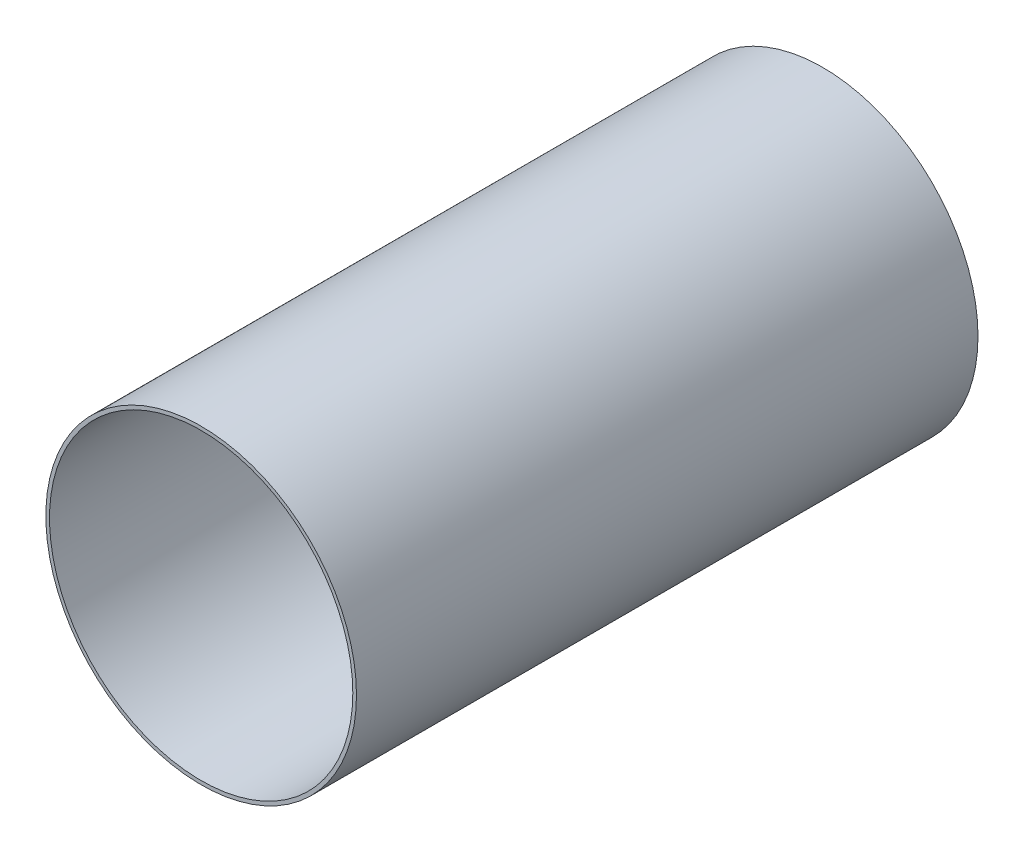
ISO-10303-21;
HEADER;
FILE_DESCRIPTION(('STEP AP214'),'2;1');
FILE_NAME('part.step','',(''),(''),'','','');
FILE_SCHEMA(('AUTOMOTIVE_DESIGN { 1 0 10303 214 1 1 1 1 }'));
ENDSEC;
DATA;
#1=APPLICATION_CONTEXT('core data for automotive mechanical design processes');
#2=APPLICATION_PROTOCOL_DEFINITION('international standard','automotive_design',2000,#1);
#3=PRODUCT_CONTEXT('',#1,'mechanical');
#4=PRODUCT('Part','Part','',(#3));
#5=PRODUCT_RELATED_PRODUCT_CATEGORY('part','',(#4));
#6=PRODUCT_DEFINITION_FORMATION('','',#4);
#7=PRODUCT_DEFINITION_CONTEXT('part definition',#1,'design');
#8=PRODUCT_DEFINITION('design','',#6,#7);
#9=PRODUCT_DEFINITION_SHAPE('','',#8);
#10=(LENGTH_UNIT() NAMED_UNIT(*) SI_UNIT(.MILLI.,.METRE.));
#11=(NAMED_UNIT(*) PLANE_ANGLE_UNIT() SI_UNIT($,.RADIAN.));
#12=(NAMED_UNIT(*) SI_UNIT($,.STERADIAN.) SOLID_ANGLE_UNIT());
#13=UNCERTAINTY_MEASURE_WITH_UNIT(LENGTH_MEASURE(1.E-05),#10,'distance_accuracy_value','');
#14=(GEOMETRIC_REPRESENTATION_CONTEXT(3) GLOBAL_UNCERTAINTY_ASSIGNED_CONTEXT((#13)) GLOBAL_UNIT_ASSIGNED_CONTEXT((#10,
#11,#12)) REPRESENTATION_CONTEXT('',''));
#15=CARTESIAN_POINT('',(0.,0.,0.));
#16=DIRECTION('',(0.,0.,1.));
#17=DIRECTION('',(1.,0.,0.));
#18=AXIS2_PLACEMENT_3D('',#15,#16,#17);
#19=CARTESIAN_POINT('',(0.,0.,127.));
#20=DIRECTION('',(0.,0.,1.));
#21=DIRECTION('',(1.,0.,0.));
#22=AXIS2_PLACEMENT_3D('',#19,#20,#21);
#23=PLANE('',#22);
#24=CARTESIAN_POINT('',(0.,0.,127.));
#25=DIRECTION('',(0.,0.,1.));
#26=DIRECTION('',(1.,0.,0.));
#27=AXIS2_PLACEMENT_3D('',#24,#25,#26);
#28=CIRCLE('',#27,63.4746);
#29=CARTESIAN_POINT('',(63.4746,0.,127.));
#30=VERTEX_POINT('',#29);
#31=EDGE_CURVE('E10',#30,#30,#28,.T.);
#32=ORIENTED_EDGE('',*,*,#31,.T.);
#33=EDGE_LOOP('',(#32));
#34=FACE_BOUND('',#33,.T.);
#35=CARTESIAN_POINT('',(0.,0.,127.));
#36=DIRECTION('',(0.,0.,1.));
#37=DIRECTION('',(1.,0.,0.));
#38=AXIS2_PLACEMENT_3D('',#35,#36,#37);
#39=CIRCLE('',#38,61.976);
#40=CARTESIAN_POINT('',(61.976,0.,127.));
#41=VERTEX_POINT('',#40);
#42=EDGE_CURVE('E54',#41,#41,#39,.T.);
#43=ORIENTED_EDGE('',*,*,#42,.F.);
#44=EDGE_LOOP('',(#43));
#45=FACE_BOUND('',#44,.T.);
#46=ADVANCED_FACE('F43',(#34,#45),#23,.T.);
#47=CARTESIAN_POINT('',(0.,0.,-127.));
#48=DIRECTION('',(0.,0.,1.));
#49=DIRECTION('',(1.,0.,0.));
#50=AXIS2_PLACEMENT_3D('',#47,#48,#49);
#51=PLANE('',#50);
#52=CARTESIAN_POINT('',(0.,0.,-127.));
#53=DIRECTION('',(0.,0.,1.));
#54=DIRECTION('',(1.,0.,0.));
#55=AXIS2_PLACEMENT_3D('',#52,#53,#54);
#56=CIRCLE('',#55,63.4746);
#57=CARTESIAN_POINT('',(63.4746,0.,-127.));
#58=VERTEX_POINT('',#57);
#59=EDGE_CURVE('E47',#58,#58,#56,.T.);
#60=ORIENTED_EDGE('',*,*,#59,.F.);
#61=EDGE_LOOP('',(#60));
#62=FACE_BOUND('',#61,.T.);
#63=CARTESIAN_POINT('',(0.,0.,-127.));
#64=DIRECTION('',(0.,0.,1.));
#65=DIRECTION('',(1.,0.,0.));
#66=AXIS2_PLACEMENT_3D('',#63,#64,#65);
#67=CIRCLE('',#66,61.976);
#68=CARTESIAN_POINT('',(61.976,0.,-127.));
#69=VERTEX_POINT('',#68);
#70=EDGE_CURVE('E56',#69,#69,#67,.T.);
#71=ORIENTED_EDGE('',*,*,#70,.T.);
#72=EDGE_LOOP('',(#71));
#73=FACE_BOUND('',#72,.T.);
#74=ADVANCED_FACE('F66',(#62,#73),#51,.F.);
#75=CARTESIAN_POINT('',(0.,0.,127.));
#76=DIRECTION('',(0.,0.,-1.));
#77=DIRECTION('',(-1.,0.,0.));
#78=AXIS2_PLACEMENT_3D('',#75,#76,#77);
#79=CYLINDRICAL_SURFACE('',#78,63.4746);
#80=ORIENTED_EDGE('',*,*,#31,.F.);
#81=EDGE_LOOP('',(#80));
#82=FACE_BOUND('',#81,.T.);
#83=ORIENTED_EDGE('',*,*,#59,.T.);
#84=EDGE_LOOP('',(#83));
#85=FACE_BOUND('',#84,.T.);
#86=ADVANCED_FACE('F45',(#82,#85),#79,.T.);
#87=CARTESIAN_POINT('',(0.,0.,127.));
#88=DIRECTION('',(0.,0.,-1.));
#89=DIRECTION('',(-1.,0.,0.));
#90=AXIS2_PLACEMENT_3D('',#87,#88,#89);
#91=CYLINDRICAL_SURFACE('',#90,61.976);
#92=ORIENTED_EDGE('',*,*,#42,.T.);
#93=EDGE_LOOP('',(#92));
#94=FACE_BOUND('',#93,.T.);
#95=ORIENTED_EDGE('',*,*,#70,.F.);
#96=EDGE_LOOP('',(#95));
#97=FACE_BOUND('',#96,.T.);
#98=ADVANCED_FACE('F62',(#94,#97),#91,.F.);
#99=CLOSED_SHELL('',(#46,#74,#86,#98));
#100=MANIFOLD_SOLID_BREP('B2',#99);
#101=ADVANCED_BREP_SHAPE_REPRESENTATION('',(#18,#100),#14);
#102=SHAPE_DEFINITION_REPRESENTATION(#9,#101);
ENDSEC;
END-ISO-10303-21;
